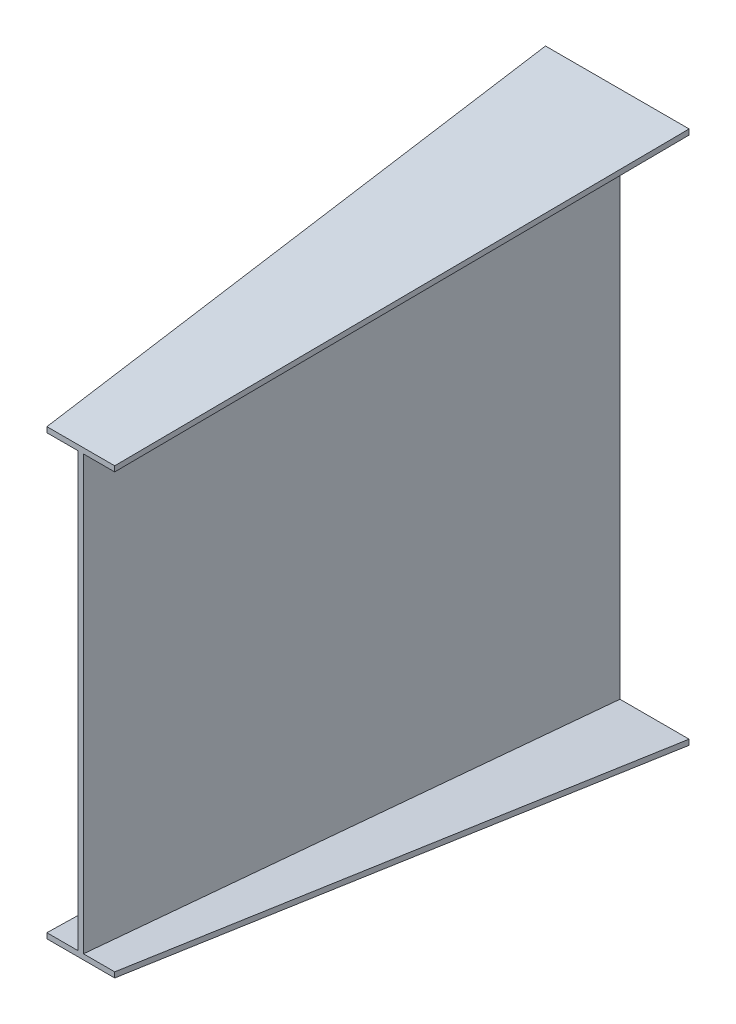
ISO-10303-21;
HEADER;
FILE_DESCRIPTION(('STEP AP214'),'2;1');
FILE_NAME('part.step','',(''),(''),'','','');
FILE_SCHEMA(('AUTOMOTIVE_DESIGN { 1 0 10303 214 1 1 1 1 }'));
ENDSEC;
DATA;
#1=APPLICATION_CONTEXT('core data for automotive mechanical design processes');
#2=APPLICATION_PROTOCOL_DEFINITION('international standard','automotive_design',2000,#1);
#3=PRODUCT_CONTEXT('',#1,'mechanical');
#4=PRODUCT('Part','Part','',(#3));
#5=PRODUCT_RELATED_PRODUCT_CATEGORY('part','',(#4));
#6=PRODUCT_DEFINITION_FORMATION('','',#4);
#7=PRODUCT_DEFINITION_CONTEXT('part definition',#1,'design');
#8=PRODUCT_DEFINITION('design','',#6,#7);
#9=PRODUCT_DEFINITION_SHAPE('','',#8);
#10=(LENGTH_UNIT() NAMED_UNIT(*) SI_UNIT(.MILLI.,.METRE.));
#11=(NAMED_UNIT(*) PLANE_ANGLE_UNIT() SI_UNIT($,.RADIAN.));
#12=(NAMED_UNIT(*) SI_UNIT($,.STERADIAN.) SOLID_ANGLE_UNIT());
#13=UNCERTAINTY_MEASURE_WITH_UNIT(LENGTH_MEASURE(1.E-05),#10,'distance_accuracy_value','');
#14=(GEOMETRIC_REPRESENTATION_CONTEXT(3) GLOBAL_UNCERTAINTY_ASSIGNED_CONTEXT((#13)) GLOBAL_UNIT_ASSIGNED_CONTEXT((#10,
#11,#12)) REPRESENTATION_CONTEXT('',''));
#15=CARTESIAN_POINT('',(0.,0.,0.));
#16=DIRECTION('',(0.,0.,1.));
#17=DIRECTION('',(1.,0.,0.));
#18=AXIS2_PLACEMENT_3D('',#15,#16,#17);
#19=CARTESIAN_POINT('',(0.,0.,1000.));
#20=DIRECTION('',(0.,0.,-1.));
#21=DIRECTION('',(-1.,0.,0.));
#22=AXIS2_PLACEMENT_3D('',#19,#20,#21);
#23=PLANE('',#22);
#24=DIRECTION('',(0.,-1.,0.));
#25=VECTOR('',#24,1.);
#26=CARTESIAN_POINT('',(-63.5,74.5,1000.));
#27=LINE('',#26,#25);
#28=CARTESIAN_POINT('',(-63.5,84.5,1000.));
#29=VERTEX_POINT('',#28);
#30=CARTESIAN_POINT('',(-63.5,74.5,1000.));
#31=VERTEX_POINT('',#30);
#32=EDGE_CURVE('E164',#29,#31,#27,.T.);
#33=ORIENTED_EDGE('',*,*,#32,.T.);
#34=DIRECTION('',(1.,0.,0.));
#35=VECTOR('',#34,1.);
#36=CARTESIAN_POINT('',(-63.5,74.5,1000.));
#37=LINE('',#36,#35);
#38=CARTESIAN_POINT('',(63.5,74.5,1000.));
#39=VERTEX_POINT('',#38);
#40=EDGE_CURVE('E12',#31,#39,#37,.T.);
#41=ORIENTED_EDGE('',*,*,#40,.T.);
#42=DIRECTION('',(0.,1.,0.));
#43=VECTOR('',#42,1.);
#44=CARTESIAN_POINT('',(63.5,74.5,1000.));
#45=LINE('',#44,#43);
#46=CARTESIAN_POINT('',(63.5,84.5,1000.));
#47=VERTEX_POINT('',#46);
#48=EDGE_CURVE('E76',#39,#47,#45,.T.);
#49=ORIENTED_EDGE('',*,*,#48,.T.);
#50=DIRECTION('',(-1.,0.,0.));
#51=VECTOR('',#50,1.);
#52=CARTESIAN_POINT('',(5.,84.5,1000.));
#53=LINE('',#52,#51);
#54=CARTESIAN_POINT('',(5.,84.5,1000.));
#55=VERTEX_POINT('',#54);
#56=EDGE_CURVE('E455',#47,#55,#53,.T.);
#57=ORIENTED_EDGE('',*,*,#56,.T.);
#58=DIRECTION('',(0.,1.,0.));
#59=VECTOR('',#58,1.);
#60=CARTESIAN_POINT('',(5.,84.5,1000.));
#61=LINE('',#60,#59);
#62=CARTESIAN_POINT('',(5.,895.5,1000.));
#63=VERTEX_POINT('',#62);
#64=EDGE_CURVE('E699',#55,#63,#61,.T.);
#65=ORIENTED_EDGE('',*,*,#64,.T.);
#66=DIRECTION('',(1.,0.,0.));
#67=VECTOR('',#66,1.);
#68=CARTESIAN_POINT('',(5.,895.5,1000.));
#69=LINE('',#68,#67);
#70=CARTESIAN_POINT('',(63.5,895.5,1000.));
#71=VERTEX_POINT('',#70);
#72=EDGE_CURVE('E523',#63,#71,#69,.T.);
#73=ORIENTED_EDGE('',*,*,#72,.T.);
#74=DIRECTION('',(0.,1.,0.));
#75=VECTOR('',#74,1.);
#76=CARTESIAN_POINT('',(63.5,895.5,1000.));
#77=LINE('',#76,#75);
#78=CARTESIAN_POINT('',(63.5,905.5,1000.));
#79=VERTEX_POINT('',#78);
#80=EDGE_CURVE('E537',#71,#79,#77,.T.);
#81=ORIENTED_EDGE('',*,*,#80,.T.);
#82=DIRECTION('',(-1.,0.,0.));
#83=VECTOR('',#82,1.);
#84=CARTESIAN_POINT('',(-63.5,905.5,1000.));
#85=LINE('',#84,#83);
#86=CARTESIAN_POINT('',(-63.5,905.5,1000.));
#87=VERTEX_POINT('',#86);
#88=EDGE_CURVE('E550',#79,#87,#85,.T.);
#89=ORIENTED_EDGE('',*,*,#88,.T.);
#90=DIRECTION('',(0.,-1.,0.));
#91=VECTOR('',#90,1.);
#92=CARTESIAN_POINT('',(-63.5,895.5,1000.));
#93=LINE('',#92,#91);
#94=CARTESIAN_POINT('',(-63.5,895.5,1000.));
#95=VERTEX_POINT('',#94);
#96=EDGE_CURVE('E666',#87,#95,#93,.T.);
#97=ORIENTED_EDGE('',*,*,#96,.T.);
#98=DIRECTION('',(1.,0.,0.));
#99=VECTOR('',#98,1.);
#100=CARTESIAN_POINT('',(-63.5,895.5,1000.));
#101=LINE('',#100,#99);
#102=CARTESIAN_POINT('',(-5.,895.5,1000.));
#103=VERTEX_POINT('',#102);
#104=EDGE_CURVE('E310',#95,#103,#101,.T.);
#105=ORIENTED_EDGE('',*,*,#104,.T.);
#106=DIRECTION('',(0.,-1.,0.));
#107=VECTOR('',#106,1.);
#108=CARTESIAN_POINT('',(-5.,84.5,1000.));
#109=LINE('',#108,#107);
#110=CARTESIAN_POINT('',(-5.,84.5,1000.));
#111=VERTEX_POINT('',#110);
#112=EDGE_CURVE('E90',#103,#111,#109,.T.);
#113=ORIENTED_EDGE('',*,*,#112,.T.);
#114=DIRECTION('',(-1.,0.,0.));
#115=VECTOR('',#114,1.);
#116=CARTESIAN_POINT('',(-63.5,84.5,1000.));
#117=LINE('',#116,#115);
#118=EDGE_CURVE('E84',#111,#29,#117,.T.);
#119=ORIENTED_EDGE('',*,*,#118,.T.);
#120=EDGE_LOOP('',(#33,#41,#49,#57,#65,#73,#81,#89,#97,#105,#113,#119));
#121=FACE_BOUND('',#120,.T.);
#122=ADVANCED_FACE('F65',(#121),#23,.F.);
#123=CARTESIAN_POINT('',(0.,0.,0.));
#124=DIRECTION('',(0.,0.,-1.));
#125=DIRECTION('',(-1.,0.,0.));
#126=AXIS2_PLACEMENT_3D('',#123,#124,#125);
#127=PLANE('',#126);
#128=DIRECTION('',(0.,-1.,0.));
#129=VECTOR('',#128,1.);
#130=CARTESIAN_POINT('',(0.,0.,0.));
#131=LINE('',#130,#129);
#132=CARTESIAN_POINT('',(-1.66533453693773E-13,980.,0.));
#133=VERTEX_POINT('',#132);
#134=CARTESIAN_POINT('',(0.,0.,0.));
#135=VERTEX_POINT('',#134);
#136=EDGE_CURVE('E282',#133,#135,#131,.T.);
#137=ORIENTED_EDGE('',*,*,#136,.F.);
#138=DIRECTION('',(1.,0.,0.));
#139=VECTOR('',#138,1.);
#140=CARTESIAN_POINT('',(-129.5,980.,0.));
#141=LINE('',#140,#139);
#142=CARTESIAN_POINT('',(-129.5,980.,0.));
#143=VERTEX_POINT('',#142);
#144=EDGE_CURVE('E273',#143,#133,#141,.T.);
#145=ORIENTED_EDGE('',*,*,#144,.F.);
#146=DIRECTION('',(0.,-1.,0.));
#147=VECTOR('',#146,1.);
#148=CARTESIAN_POINT('',(-129.5,980.,0.));
#149=LINE('',#148,#147);
#150=CARTESIAN_POINT('',(-129.5,990.,0.));
#151=VERTEX_POINT('',#150);
#152=EDGE_CURVE('E281',#151,#143,#149,.T.);
#153=ORIENTED_EDGE('',*,*,#152,.F.);
#154=DIRECTION('',(-1.,0.,0.));
#155=VECTOR('',#154,1.);
#156=CARTESIAN_POINT('',(-129.5,990.,0.));
#157=LINE('',#156,#155);
#158=CARTESIAN_POINT('',(139.5,990.,0.));
#159=VERTEX_POINT('',#158);
#160=EDGE_CURVE('E286',#159,#151,#157,.T.);
#161=ORIENTED_EDGE('',*,*,#160,.F.);
#162=DIRECTION('',(0.,1.,0.));
#163=VECTOR('',#162,1.);
#164=CARTESIAN_POINT('',(139.5,980.,0.));
#165=LINE('',#164,#163);
#166=CARTESIAN_POINT('',(139.5,980.,0.));
#167=VERTEX_POINT('',#166);
#168=EDGE_CURVE('E587',#167,#159,#165,.T.);
#169=ORIENTED_EDGE('',*,*,#168,.F.);
#170=DIRECTION('',(1.,0.,0.));
#171=VECTOR('',#170,1.);
#172=CARTESIAN_POINT('',(9.99999999999982,980.,0.));
#173=LINE('',#172,#171);
#174=CARTESIAN_POINT('',(9.99999999999982,980.,0.));
#175=VERTEX_POINT('',#174);
#176=EDGE_CURVE('E601',#175,#167,#173,.T.);
#177=ORIENTED_EDGE('',*,*,#176,.F.);
#178=DIRECTION('',(0.,1.,0.));
#179=VECTOR('',#178,1.);
#180=CARTESIAN_POINT('',(10.,0.,0.));
#181=LINE('',#180,#179);
#182=CARTESIAN_POINT('',(10.,0.,0.));
#183=VERTEX_POINT('',#182);
#184=EDGE_CURVE('E492',#183,#175,#181,.T.);
#185=ORIENTED_EDGE('',*,*,#184,.F.);
#186=DIRECTION('',(-1.,0.,0.));
#187=VECTOR('',#186,1.);
#188=CARTESIAN_POINT('',(10.,0.,0.));
#189=LINE('',#188,#187);
#190=CARTESIAN_POINT('',(139.5,0.,0.));
#191=VERTEX_POINT('',#190);
#192=EDGE_CURVE('E612',#191,#183,#189,.T.);
#193=ORIENTED_EDGE('',*,*,#192,.F.);
#194=DIRECTION('',(0.,1.,0.));
#195=VECTOR('',#194,1.);
#196=CARTESIAN_POINT('',(139.5,-10.,0.));
#197=LINE('',#196,#195);
#198=CARTESIAN_POINT('',(139.5,-10.,0.));
#199=VERTEX_POINT('',#198);
#200=EDGE_CURVE('E616',#199,#191,#197,.T.);
#201=ORIENTED_EDGE('',*,*,#200,.F.);
#202=DIRECTION('',(1.,0.,0.));
#203=VECTOR('',#202,1.);
#204=CARTESIAN_POINT('',(-129.5,-10.,0.));
#205=LINE('',#204,#203);
#206=CARTESIAN_POINT('',(-129.5,-10.,0.));
#207=VERTEX_POINT('',#206);
#208=EDGE_CURVE('E188',#207,#199,#205,.T.);
#209=ORIENTED_EDGE('',*,*,#208,.F.);
#210=DIRECTION('',(0.,-1.,0.));
#211=VECTOR('',#210,1.);
#212=CARTESIAN_POINT('',(-129.5,-10.,0.));
#213=LINE('',#212,#211);
#214=CARTESIAN_POINT('',(-129.5,0.,0.));
#215=VERTEX_POINT('',#214);
#216=EDGE_CURVE('E161',#215,#207,#213,.T.);
#217=ORIENTED_EDGE('',*,*,#216,.F.);
#218=DIRECTION('',(-1.,0.,0.));
#219=VECTOR('',#218,1.);
#220=CARTESIAN_POINT('',(-129.5,0.,0.));
#221=LINE('',#220,#219);
#222=EDGE_CURVE('E172',#135,#215,#221,.T.);
#223=ORIENTED_EDGE('',*,*,#222,.F.);
#224=EDGE_LOOP('',(#137,#145,#153,#161,#169,#177,#185,#193,#201,#209,#217,#223));
#225=FACE_BOUND('',#224,.T.);
#226=ADVANCED_FACE('F186',(#225),#127,.T.);
#227=CARTESIAN_POINT('',(0.,973.052164283972,82.2229078819956));
#228=DIRECTION('',(0.,0.996448880634796,0.0841999304136403));
#229=DIRECTION('',(0.,-0.0841999304136403,0.996448880634796));
#230=AXIS2_PLACEMENT_3D('',#227,#228,#229);
#231=PLANE('',#230);
#232=DIRECTION('',(-0.0755138865361133,-0.0839595185829155,0.993603770212018));
#233=VECTOR('',#232,1.);
#234=CARTESIAN_POINT('',(139.5,980.,0.));
#235=LINE('',#234,#233);
#236=EDGE_CURVE('E181',#167,#71,#235,.T.);
#237=ORIENTED_EDGE('',*,*,#236,.T.);
#238=ORIENTED_EDGE('',*,*,#72,.F.);
#239=DIRECTION('',(-0.00498218256779821,-0.0841988853957929,0.996436513559679));
#240=VECTOR('',#239,1.);
#241=CARTESIAN_POINT('',(9.99999999999982,980.,0.));
#242=LINE('',#241,#240);
#243=EDGE_CURVE('E497',#175,#63,#242,.T.);
#244=ORIENTED_EDGE('',*,*,#243,.F.);
#245=ORIENTED_EDGE('',*,*,#176,.T.);
#246=EDGE_LOOP('',(#237,#238,#244,#245));
#247=FACE_BOUND('',#246,.T.);
#248=ADVANCED_FACE('F208',(#247),#231,.F.);
#249=CARTESIAN_POINT('',(9.99975000624966,0.,0.0499987500312465));
#250=DIRECTION('',(-0.99998750023437,0.,-0.00499993750117167));
#251=DIRECTION('',(-0.00499993750117167,0.,0.99998750023437));
#252=AXIS2_PLACEMENT_3D('',#249,#250,#251);
#253=PLANE('',#252);
#254=ORIENTED_EDGE('',*,*,#243,.T.);
#255=ORIENTED_EDGE('',*,*,#64,.F.);
#256=DIRECTION('',(-0.00498218256779839,0.0841988853957928,0.996436513559679));
#257=VECTOR('',#256,1.);
#258=CARTESIAN_POINT('',(10.,0.,0.));
#259=LINE('',#258,#257);
#260=EDGE_CURVE('E476',#183,#55,#259,.T.);
#261=ORIENTED_EDGE('',*,*,#260,.F.);
#262=ORIENTED_EDGE('',*,*,#184,.T.);
#263=EDGE_LOOP('',(#254,#255,#261,#262));
#264=FACE_BOUND('',#263,.T.);
#265=ADVANCED_FACE('F499',(#264),#253,.F.);
#266=CARTESIAN_POINT('',(138.698875296289,0.,10.5411145225179));
#267=DIRECTION('',(-0.997124450900044,0.,-0.0757814582684032));
#268=DIRECTION('',(-0.0757814582684032,0.,0.997124450900044));
#269=AXIS2_PLACEMENT_3D('',#266,#267,#268);
#270=PLANE('',#269);
#271=DIRECTION('',(-0.0755138865361132,-0.0839595185829155,0.993603770212018));
#272=VECTOR('',#271,1.);
#273=CARTESIAN_POINT('',(139.5,990.,0.));
#274=LINE('',#273,#272);
#275=EDGE_CURVE('E318',#159,#79,#274,.T.);
#276=ORIENTED_EDGE('',*,*,#275,.T.);
#277=ORIENTED_EDGE('',*,*,#80,.F.);
#278=ORIENTED_EDGE('',*,*,#236,.F.);
#279=ORIENTED_EDGE('',*,*,#168,.T.);
#280=EDGE_LOOP('',(#276,#277,#278,#279));
#281=FACE_BOUND('',#280,.T.);
#282=ADVANCED_FACE('F508',(#281),#270,.F.);
#283=CARTESIAN_POINT('',(0.,982.981268001155,83.0619171460976));
#284=DIRECTION('',(0.,-0.996448880634796,-0.0841999304136403));
#285=DIRECTION('',(0.,0.0841999304136403,-0.996448880634796));
#286=AXIS2_PLACEMENT_3D('',#283,#284,#285);
#287=PLANE('',#286);
#288=DIRECTION('',(0.0656238637777919,-0.0840184316549,0.994300966330178));
#289=VECTOR('',#288,1.);
#290=CARTESIAN_POINT('',(-129.5,990.,0.));
#291=LINE('',#290,#289);
#292=EDGE_CURVE('E301',#151,#87,#291,.T.);
#293=ORIENTED_EDGE('',*,*,#292,.T.);
#294=ORIENTED_EDGE('',*,*,#88,.F.);
#295=ORIENTED_EDGE('',*,*,#275,.F.);
#296=ORIENTED_EDGE('',*,*,#160,.T.);
#297=EDGE_LOOP('',(#293,#294,#295,#296));
#298=FACE_BOUND('',#297,.T.);
#299=ADVANCED_FACE('F554',(#298),#287,.F.);
#300=CARTESIAN_POINT('',(-128.938344571049,0.,8.50993074168923));
#301=DIRECTION('',(0.997829089794705,0.,-0.0658567199264507));
#302=DIRECTION('',(-0.0658567199264507,0.,-0.997829089794705));
#303=AXIS2_PLACEMENT_3D('',#300,#301,#302);
#304=PLANE('',#303);
#305=DIRECTION('',(0.0656238637777919,-0.0840184316549,0.994300966330178));
#306=VECTOR('',#305,1.);
#307=CARTESIAN_POINT('',(-129.5,980.,0.));
#308=LINE('',#307,#306);
#309=EDGE_CURVE('E299',#143,#95,#308,.T.);
#310=ORIENTED_EDGE('',*,*,#309,.T.);
#311=ORIENTED_EDGE('',*,*,#96,.F.);
#312=ORIENTED_EDGE('',*,*,#292,.F.);
#313=ORIENTED_EDGE('',*,*,#152,.T.);
#314=EDGE_LOOP('',(#310,#311,#312,#313));
#315=FACE_BOUND('',#314,.T.);
#316=ADVANCED_FACE('F297',(#315),#304,.F.);
#317=CARTESIAN_POINT('',(0.,973.052164283971,82.2229078819956));
#318=DIRECTION('',(0.,0.996448880634796,0.0841999304136403));
#319=DIRECTION('',(0.,-0.0841999304136403,0.996448880634796));
#320=AXIS2_PLACEMENT_3D('',#317,#318,#319);
#321=PLANE('',#320);
#322=DIRECTION('',(-0.00498218256779821,-0.0841988853957929,0.996436513559679));
#323=VECTOR('',#322,1.);
#324=CARTESIAN_POINT('',(-1.80411241501588E-13,980.,0.));
#325=LINE('',#324,#323);
#326=EDGE_CURVE('E313',#133,#103,#325,.T.);
#327=ORIENTED_EDGE('',*,*,#326,.T.);
#328=ORIENTED_EDGE('',*,*,#104,.F.);
#329=ORIENTED_EDGE('',*,*,#309,.F.);
#330=ORIENTED_EDGE('',*,*,#144,.T.);
#331=EDGE_LOOP('',(#327,#328,#329,#330));
#332=FACE_BOUND('',#331,.T.);
#333=ADVANCED_FACE('F307',(#332),#321,.F.);
#334=CARTESIAN_POINT('',(0.,0.,0.));
#335=DIRECTION('',(0.99998750023437,0.,0.00499993750117185));
#336=DIRECTION('',(0.00499993750117185,0.,-0.99998750023437));
#337=AXIS2_PLACEMENT_3D('',#334,#335,#336);
#338=PLANE('',#337);
#339=DIRECTION('',(-0.00498218256779839,0.0841988853957928,0.996436513559679));
#340=VECTOR('',#339,1.);
#341=CARTESIAN_POINT('',(0.,0.,0.));
#342=LINE('',#341,#340);
#343=EDGE_CURVE('E169',#135,#111,#342,.T.);
#344=ORIENTED_EDGE('',*,*,#343,.T.);
#345=ORIENTED_EDGE('',*,*,#112,.F.);
#346=ORIENTED_EDGE('',*,*,#326,.F.);
#347=ORIENTED_EDGE('',*,*,#136,.T.);
#348=EDGE_LOOP('',(#344,#345,#346,#347));
#349=FACE_BOUND('',#348,.T.);
#350=ADVANCED_FACE('F338',(#349),#338,.F.);
#351=CARTESIAN_POINT('',(0.,0.,0.));
#352=DIRECTION('',(0.,-0.996448880634796,0.0841999304136402));
#353=DIRECTION('',(0.,-0.0841999304136403,-0.996448880634796));
#354=AXIS2_PLACEMENT_3D('',#351,#352,#353);
#355=PLANE('',#354);
#356=DIRECTION('',(0.0656238637777917,0.0840184316549,0.994300966330178));
#357=VECTOR('',#356,1.);
#358=CARTESIAN_POINT('',(-129.5,0.,0.));
#359=LINE('',#358,#357);
#360=EDGE_CURVE('E157',#215,#29,#359,.T.);
#361=ORIENTED_EDGE('',*,*,#360,.T.);
#362=ORIENTED_EDGE('',*,*,#118,.F.);
#363=ORIENTED_EDGE('',*,*,#343,.F.);
#364=ORIENTED_EDGE('',*,*,#222,.T.);
#365=EDGE_LOOP('',(#361,#362,#363,#364));
#366=FACE_BOUND('',#365,.T.);
#367=ADVANCED_FACE('F174',(#366),#355,.F.);
#368=CARTESIAN_POINT('',(-128.938344571049,0.,8.5099307416892));
#369=DIRECTION('',(0.997829089794705,0.,-0.0658567199264505));
#370=DIRECTION('',(-0.0658567199264505,0.,-0.997829089794705));
#371=AXIS2_PLACEMENT_3D('',#368,#369,#370);
#372=PLANE('',#371);
#373=DIRECTION('',(0.0656238637777917,0.0840184316549,0.994300966330178));
#374=VECTOR('',#373,1.);
#375=CARTESIAN_POINT('',(-129.5,-10.,0.));
#376=LINE('',#375,#374);
#377=EDGE_CURVE('E168',#207,#31,#376,.T.);
#378=ORIENTED_EDGE('',*,*,#377,.T.);
#379=ORIENTED_EDGE('',*,*,#32,.F.);
#380=ORIENTED_EDGE('',*,*,#360,.F.);
#381=ORIENTED_EDGE('',*,*,#216,.T.);
#382=EDGE_LOOP('',(#378,#379,#380,#381));
#383=FACE_BOUND('',#382,.T.);
#384=ADVANCED_FACE('F159',(#383),#372,.F.);
#385=CARTESIAN_POINT('',(0.,-9.92910371718339,0.839009264101996));
#386=DIRECTION('',(0.,0.996448880634796,-0.0841999304136403));
#387=DIRECTION('',(0.,0.0841999304136403,0.996448880634796));
#388=AXIS2_PLACEMENT_3D('',#385,#386,#387);
#389=PLANE('',#388);
#390=DIRECTION('',(-0.0755138865361134,0.0839595185829155,0.993603770212018));
#391=VECTOR('',#390,1.);
#392=CARTESIAN_POINT('',(139.5,-10.,0.));
#393=LINE('',#392,#391);
#394=EDGE_CURVE('E403',#199,#39,#393,.T.);
#395=ORIENTED_EDGE('',*,*,#394,.T.);
#396=ORIENTED_EDGE('',*,*,#40,.F.);
#397=ORIENTED_EDGE('',*,*,#377,.F.);
#398=ORIENTED_EDGE('',*,*,#208,.T.);
#399=EDGE_LOOP('',(#395,#396,#397,#398));
#400=FACE_BOUND('',#399,.T.);
#401=ADVANCED_FACE('F414',(#400),#389,.F.);
#402=CARTESIAN_POINT('',(138.698875296289,0.,10.5411145225179));
#403=DIRECTION('',(-0.997124450900044,0.,-0.0757814582684034));
#404=DIRECTION('',(-0.0757814582684034,0.,0.997124450900044));
#405=AXIS2_PLACEMENT_3D('',#402,#403,#404);
#406=PLANE('',#405);
#407=DIRECTION('',(-0.0755138865361134,0.0839595185829155,0.993603770212018));
#408=VECTOR('',#407,1.);
#409=CARTESIAN_POINT('',(139.5,0.,0.));
#410=LINE('',#409,#408);
#411=EDGE_CURVE('E484',#191,#47,#410,.T.);
#412=ORIENTED_EDGE('',*,*,#411,.T.);
#413=ORIENTED_EDGE('',*,*,#48,.F.);
#414=ORIENTED_EDGE('',*,*,#394,.F.);
#415=ORIENTED_EDGE('',*,*,#200,.T.);
#416=EDGE_LOOP('',(#412,#413,#414,#415));
#417=FACE_BOUND('',#416,.T.);
#418=ADVANCED_FACE('F423',(#417),#406,.F.);
#419=CARTESIAN_POINT('',(0.,0.,0.));
#420=DIRECTION('',(0.,-0.996448880634796,0.0841999304136403));
#421=DIRECTION('',(0.,-0.0841999304136403,-0.996448880634796));
#422=AXIS2_PLACEMENT_3D('',#419,#420,#421);
#423=PLANE('',#422);
#424=ORIENTED_EDGE('',*,*,#260,.T.);
#425=ORIENTED_EDGE('',*,*,#56,.F.);
#426=ORIENTED_EDGE('',*,*,#411,.F.);
#427=ORIENTED_EDGE('',*,*,#192,.T.);
#428=EDGE_LOOP('',(#424,#425,#426,#427));
#429=FACE_BOUND('',#428,.T.);
#430=ADVANCED_FACE('F461',(#429),#423,.F.);
#431=CLOSED_SHELL('',(#122,#226,#248,#265,#282,#299,#316,#333,#350,#367,#384,#401,#418,#430));
#432=MANIFOLD_SOLID_BREP('B2',#431);
#433=ADVANCED_BREP_SHAPE_REPRESENTATION('',(#18,#432),#14);
#434=SHAPE_DEFINITION_REPRESENTATION(#9,#433);
ENDSEC;
END-ISO-10303-21;
